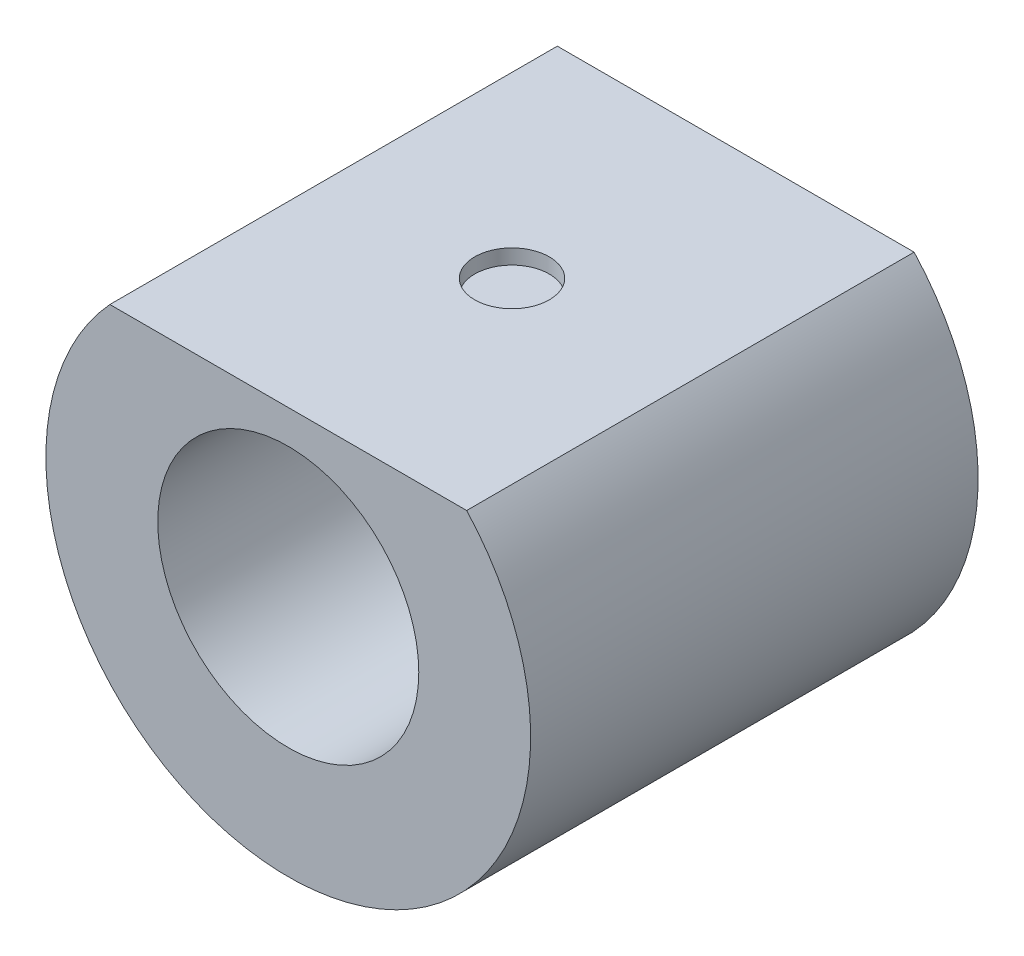
ISO-10303-21;
HEADER;
FILE_DESCRIPTION(('STEP AP214'),'2;1');
FILE_NAME('part.step','',(''),(''),'','','');
FILE_SCHEMA(('AUTOMOTIVE_DESIGN { 1 0 10303 214 1 1 1 1 }'));
ENDSEC;
DATA;
#1=APPLICATION_CONTEXT('core data for automotive mechanical design processes');
#2=APPLICATION_PROTOCOL_DEFINITION('international standard','automotive_design',2000,#1);
#3=PRODUCT_CONTEXT('',#1,'mechanical');
#4=PRODUCT('Part','Part','',(#3));
#5=PRODUCT_RELATED_PRODUCT_CATEGORY('part','',(#4));
#6=PRODUCT_DEFINITION_FORMATION('','',#4);
#7=PRODUCT_DEFINITION_CONTEXT('part definition',#1,'design');
#8=PRODUCT_DEFINITION('design','',#6,#7);
#9=PRODUCT_DEFINITION_SHAPE('','',#8);
#10=(LENGTH_UNIT() NAMED_UNIT(*) SI_UNIT(.MILLI.,.METRE.));
#11=(NAMED_UNIT(*) PLANE_ANGLE_UNIT() SI_UNIT($,.RADIAN.));
#12=(NAMED_UNIT(*) SI_UNIT($,.STERADIAN.) SOLID_ANGLE_UNIT());
#13=UNCERTAINTY_MEASURE_WITH_UNIT(LENGTH_MEASURE(1.E-05),#10,'distance_accuracy_value','');
#14=(GEOMETRIC_REPRESENTATION_CONTEXT(3) GLOBAL_UNCERTAINTY_ASSIGNED_CONTEXT((#13)) GLOBAL_UNIT_ASSIGNED_CONTEXT((#10,
#11,#12)) REPRESENTATION_CONTEXT('',''));
#15=CARTESIAN_POINT('',(0.,0.,0.));
#16=DIRECTION('',(0.,0.,1.));
#17=DIRECTION('',(1.,0.,0.));
#18=AXIS2_PLACEMENT_3D('',#15,#16,#17);
#19=CARTESIAN_POINT('',(0.,0.,60.));
#20=DIRECTION('',(0.,0.,-1.));
#21=DIRECTION('',(-1.,0.,0.));
#22=AXIS2_PLACEMENT_3D('',#19,#20,#21);
#23=CYLINDRICAL_SURFACE('',#22,32.5);
#24=CARTESIAN_POINT('',(0.,0.,60.));
#25=DIRECTION('',(0.,0.,1.));
#26=DIRECTION('',(1.,0.,0.));
#27=AXIS2_PLACEMENT_3D('',#24,#25,#26);
#28=CIRCLE('',#27,32.5);
#29=CARTESIAN_POINT('',(-23.9217474278114,22.,60.));
#30=VERTEX_POINT('',#29);
#31=CARTESIAN_POINT('',(23.9217474278114,22.,60.));
#32=VERTEX_POINT('',#31);
#33=EDGE_CURVE('E40',#30,#32,#28,.T.);
#34=ORIENTED_EDGE('',*,*,#33,.F.);
#35=DIRECTION('',(0.,0.,-1.));
#36=VECTOR('',#35,1.);
#37=CARTESIAN_POINT('',(-23.9217474278114,22.,60.));
#38=LINE('',#37,#36);
#39=CARTESIAN_POINT('',(-23.9217474278114,22.,0.));
#40=VERTEX_POINT('',#39);
#41=EDGE_CURVE('E54',#30,#40,#38,.T.);
#42=ORIENTED_EDGE('',*,*,#41,.T.);
#43=CARTESIAN_POINT('',(0.,0.,0.));
#44=DIRECTION('',(0.,0.,1.));
#45=DIRECTION('',(1.,0.,0.));
#46=AXIS2_PLACEMENT_3D('',#43,#44,#45);
#47=CIRCLE('',#46,32.5);
#48=CARTESIAN_POINT('',(23.9217474278114,22.,0.));
#49=VERTEX_POINT('',#48);
#50=EDGE_CURVE('E70',#40,#49,#47,.T.);
#51=ORIENTED_EDGE('',*,*,#50,.T.);
#52=DIRECTION('',(0.,0.,-1.));
#53=VECTOR('',#52,1.);
#54=CARTESIAN_POINT('',(23.9217474278114,22.,60.));
#55=LINE('',#54,#53);
#56=EDGE_CURVE('E47',#49,#32,#55,.F.);
#57=ORIENTED_EDGE('',*,*,#56,.T.);
#58=EDGE_LOOP('',(#34,#42,#51,#57));
#59=FACE_BOUND('',#58,.T.);
#60=ADVANCED_FACE('F33',(#59),#23,.T.);
#61=CARTESIAN_POINT('',(0.,0.,60.));
#62=DIRECTION('',(0.,0.,1.));
#63=DIRECTION('',(1.,0.,0.));
#64=AXIS2_PLACEMENT_3D('',#61,#62,#63);
#65=PLANE('',#64);
#66=DIRECTION('',(1.,0.,0.));
#67=VECTOR('',#66,1.);
#68=CARTESIAN_POINT('',(-33.9905802567463,22.,60.));
#69=LINE('',#68,#67);
#70=EDGE_CURVE('E57',#30,#32,#69,.T.);
#71=ORIENTED_EDGE('',*,*,#70,.F.);
#72=ORIENTED_EDGE('',*,*,#33,.T.);
#73=EDGE_LOOP('',(#71,#72));
#74=FACE_BOUND('',#73,.T.);
#75=CARTESIAN_POINT('',(0.,0.,60.));
#76=DIRECTION('',(0.,0.,1.));
#77=DIRECTION('',(1.,0.,0.));
#78=AXIS2_PLACEMENT_3D('',#75,#76,#77);
#79=CIRCLE('',#78,17.5);
#80=CARTESIAN_POINT('',(17.5,0.,60.));
#81=VERTEX_POINT('',#80);
#82=EDGE_CURVE('E74',#81,#81,#79,.T.);
#83=ORIENTED_EDGE('',*,*,#82,.F.);
#84=EDGE_LOOP('',(#83));
#85=FACE_BOUND('',#84,.T.);
#86=ADVANCED_FACE('F66',(#74,#85),#65,.T.);
#87=CARTESIAN_POINT('',(0.,0.,0.));
#88=DIRECTION('',(0.,0.,1.));
#89=DIRECTION('',(1.,0.,0.));
#90=AXIS2_PLACEMENT_3D('',#87,#88,#89);
#91=PLANE('',#90);
#92=CARTESIAN_POINT('',(0.,0.,0.));
#93=DIRECTION('',(0.,0.,1.));
#94=DIRECTION('',(1.,0.,0.));
#95=AXIS2_PLACEMENT_3D('',#92,#93,#94);
#96=CIRCLE('',#95,6.5);
#97=CARTESIAN_POINT('',(6.5,0.,0.));
#98=VERTEX_POINT('',#97);
#99=EDGE_CURVE('E77',#98,#98,#96,.T.);
#100=ORIENTED_EDGE('',*,*,#99,.T.);
#101=EDGE_LOOP('',(#100));
#102=FACE_BOUND('',#101,.T.);
#103=ORIENTED_EDGE('',*,*,#50,.F.);
#104=DIRECTION('',(1.,0.,0.));
#105=VECTOR('',#104,1.);
#106=CARTESIAN_POINT('',(0.,22.,0.));
#107=LINE('',#106,#105);
#108=EDGE_CURVE('E11',#40,#49,#107,.T.);
#109=ORIENTED_EDGE('',*,*,#108,.T.);
#110=EDGE_LOOP('',(#103,#109));
#111=FACE_BOUND('',#110,.T.);
#112=ADVANCED_FACE('F112',(#102,#111),#91,.F.);
#113=CARTESIAN_POINT('',(0.,0.,8.));
#114=DIRECTION('',(0.,0.,1.));
#115=DIRECTION('',(1.,0.,0.));
#116=AXIS2_PLACEMENT_3D('',#113,#114,#115);
#117=CYLINDRICAL_SURFACE('',#116,17.5);
#118=CARTESIAN_POINT('',(0.,0.,8.));
#119=DIRECTION('',(0.,0.,1.));
#120=DIRECTION('',(1.,0.,0.));
#121=AXIS2_PLACEMENT_3D('',#118,#119,#120);
#122=CIRCLE('',#121,17.5);
#123=CARTESIAN_POINT('',(17.5,0.,8.));
#124=VERTEX_POINT('',#123);
#125=EDGE_CURVE('E72',#124,#124,#122,.T.);
#126=ORIENTED_EDGE('',*,*,#125,.F.);
#127=EDGE_LOOP('',(#126));
#128=FACE_BOUND('',#127,.T.);
#129=ORIENTED_EDGE('',*,*,#82,.T.);
#130=EDGE_LOOP('',(#129));
#131=FACE_BOUND('',#130,.T.);
#132=ADVANCED_FACE('F117',(#128,#131),#117,.F.);
#133=CARTESIAN_POINT('',(0.,0.,8.));
#134=DIRECTION('',(0.,0.,1.));
#135=DIRECTION('',(1.,0.,0.));
#136=AXIS2_PLACEMENT_3D('',#133,#134,#135);
#137=PLANE('',#136);
#138=CARTESIAN_POINT('',(0.,0.,8.));
#139=DIRECTION('',(0.,0.,1.));
#140=DIRECTION('',(1.,0.,0.));
#141=AXIS2_PLACEMENT_3D('',#138,#139,#140);
#142=CIRCLE('',#141,6.5);
#143=CARTESIAN_POINT('',(6.5,0.,8.));
#144=VERTEX_POINT('',#143);
#145=EDGE_CURVE('E62',#144,#144,#142,.T.);
#146=ORIENTED_EDGE('',*,*,#145,.F.);
#147=EDGE_LOOP('',(#146));
#148=FACE_BOUND('',#147,.T.);
#149=ORIENTED_EDGE('',*,*,#125,.T.);
#150=EDGE_LOOP('',(#149));
#151=FACE_BOUND('',#150,.T.);
#152=ADVANCED_FACE('F105',(#148,#151),#137,.T.);
#153=CARTESIAN_POINT('',(0.,0.,0.));
#154=DIRECTION('',(0.,0.,1.));
#155=DIRECTION('',(1.,0.,0.));
#156=AXIS2_PLACEMENT_3D('',#153,#154,#155);
#157=CYLINDRICAL_SURFACE('',#156,6.5);
#158=ORIENTED_EDGE('',*,*,#99,.F.);
#159=EDGE_LOOP('',(#158));
#160=FACE_BOUND('',#159,.T.);
#161=ORIENTED_EDGE('',*,*,#145,.T.);
#162=EDGE_LOOP('',(#161));
#163=FACE_BOUND('',#162,.T.);
#164=ADVANCED_FACE('F100',(#160,#163),#157,.F.);
#165=CARTESIAN_POINT('',(-33.9905802567463,22.,0.));
#166=DIRECTION('',(0.,-1.,0.));
#167=DIRECTION('',(0.,0.,-1.));
#168=AXIS2_PLACEMENT_3D('',#165,#166,#167);
#169=PLANE('',#168);
#170=CARTESIAN_POINT('',(0.,22.,30.));
#171=DIRECTION('',(0.,1.,0.));
#172=DIRECTION('',(0.,0.,1.));
#173=AXIS2_PLACEMENT_3D('',#170,#171,#172);
#174=CIRCLE('',#173,5.);
#175=CARTESIAN_POINT('',(0.,22.,35.));
#176=VERTEX_POINT('',#175);
#177=EDGE_CURVE('E85',#176,#176,#174,.T.);
#178=ORIENTED_EDGE('',*,*,#177,.F.);
#179=EDGE_LOOP('',(#178));
#180=FACE_BOUND('',#179,.T.);
#181=ORIENTED_EDGE('',*,*,#70,.T.);
#182=ORIENTED_EDGE('',*,*,#56,.F.);
#183=ORIENTED_EDGE('',*,*,#108,.F.);
#184=ORIENTED_EDGE('',*,*,#41,.F.);
#185=EDGE_LOOP('',(#181,#182,#183,#184));
#186=FACE_BOUND('',#185,.T.);
#187=ADVANCED_FACE('F56',(#180,#186),#169,.F.);
#188=CARTESIAN_POINT('',(0.,20.,30.));
#189=DIRECTION('',(0.,1.,0.));
#190=DIRECTION('',(0.,0.,1.));
#191=AXIS2_PLACEMENT_3D('',#188,#189,#190);
#192=CYLINDRICAL_SURFACE('',#191,5.);
#193=CARTESIAN_POINT('',(0.,20.,30.));
#194=DIRECTION('',(0.,1.,0.));
#195=DIRECTION('',(0.,0.,1.));
#196=AXIS2_PLACEMENT_3D('',#193,#194,#195);
#197=CIRCLE('',#196,5.);
#198=CARTESIAN_POINT('',(0.,20.,35.));
#199=VERTEX_POINT('',#198);
#200=EDGE_CURVE('E68',#199,#199,#197,.T.);
#201=ORIENTED_EDGE('',*,*,#200,.F.);
#202=EDGE_LOOP('',(#201));
#203=FACE_BOUND('',#202,.T.);
#204=ORIENTED_EDGE('',*,*,#177,.T.);
#205=EDGE_LOOP('',(#204));
#206=FACE_BOUND('',#205,.T.);
#207=ADVANCED_FACE('F93',(#203,#206),#192,.F.);
#208=CARTESIAN_POINT('',(0.,20.,30.));
#209=DIRECTION('',(0.,1.,0.));
#210=DIRECTION('',(0.,0.,1.));
#211=AXIS2_PLACEMENT_3D('',#208,#209,#210);
#212=PLANE('',#211);
#213=ORIENTED_EDGE('',*,*,#200,.T.);
#214=EDGE_LOOP('',(#213));
#215=FACE_BOUND('',#214,.T.);
#216=ADVANCED_FACE('F91',(#215),#212,.T.);
#217=CLOSED_SHELL('',(#60,#86,#112,#132,#152,#164,#187,#207,#216));
#218=MANIFOLD_SOLID_BREP('B2',#217);
#219=ADVANCED_BREP_SHAPE_REPRESENTATION('',(#18,#218),#14);
#220=SHAPE_DEFINITION_REPRESENTATION(#9,#219);
ENDSEC;
END-ISO-10303-21;
